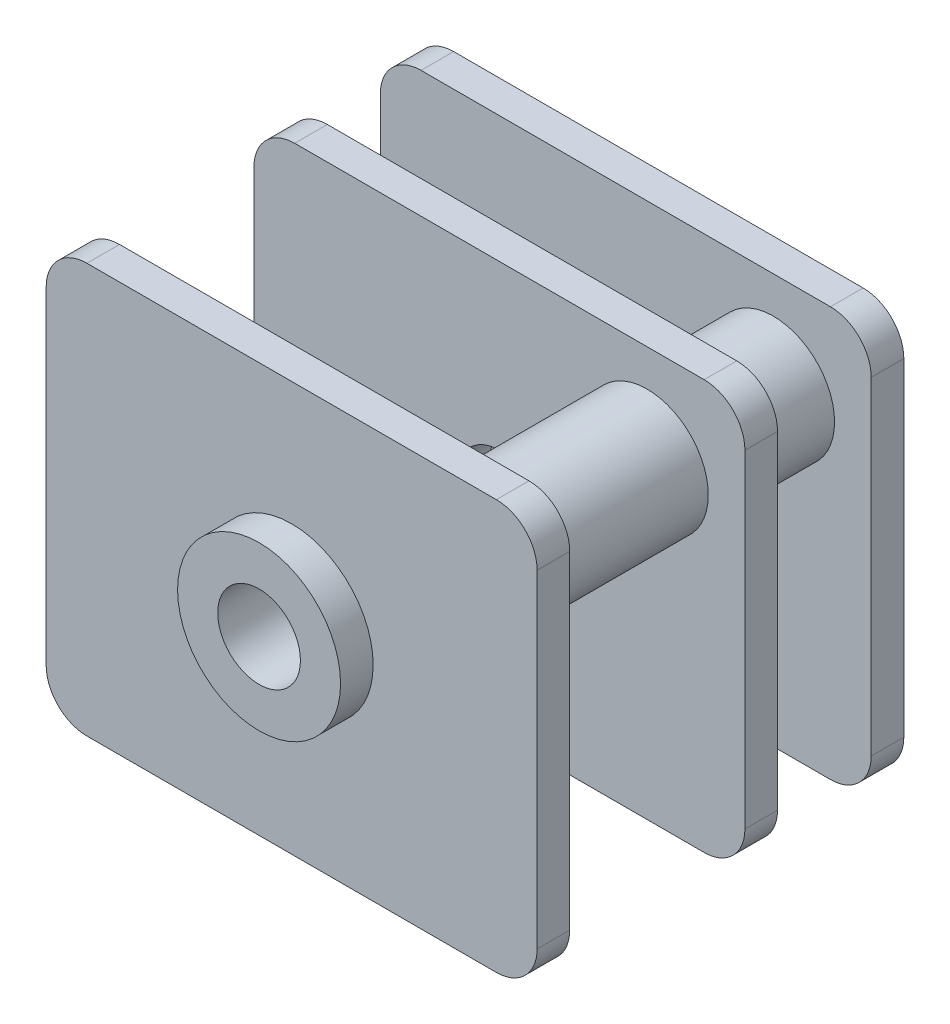
ISO-10303-21;
HEADER;
FILE_DESCRIPTION(('STEP AP214'),'2;1');
FILE_NAME('part.step','',(''),(''),'','','');
FILE_SCHEMA(('AUTOMOTIVE_DESIGN { 1 0 10303 214 1 1 1 1 }'));
ENDSEC;
DATA;
#1=APPLICATION_CONTEXT('core data for automotive mechanical design processes');
#2=APPLICATION_PROTOCOL_DEFINITION('international standard','automotive_design',2000,#1);
#3=PRODUCT_CONTEXT('',#1,'mechanical');
#4=PRODUCT('Part','Part','',(#3));
#5=PRODUCT_RELATED_PRODUCT_CATEGORY('part','',(#4));
#6=PRODUCT_DEFINITION_FORMATION('','',#4);
#7=PRODUCT_DEFINITION_CONTEXT('part definition',#1,'design');
#8=PRODUCT_DEFINITION('design','',#6,#7);
#9=PRODUCT_DEFINITION_SHAPE('','',#8);
#10=(LENGTH_UNIT() NAMED_UNIT(*) SI_UNIT(.MILLI.,.METRE.));
#11=(NAMED_UNIT(*) PLANE_ANGLE_UNIT() SI_UNIT($,.RADIAN.));
#12=(NAMED_UNIT(*) SI_UNIT($,.STERADIAN.) SOLID_ANGLE_UNIT());
#13=UNCERTAINTY_MEASURE_WITH_UNIT(LENGTH_MEASURE(1.E-05),#10,'distance_accuracy_value','');
#14=(GEOMETRIC_REPRESENTATION_CONTEXT(3) GLOBAL_UNCERTAINTY_ASSIGNED_CONTEXT((#13)) GLOBAL_UNIT_ASSIGNED_CONTEXT((#10,
#11,#12)) REPRESENTATION_CONTEXT('',''));
#15=CARTESIAN_POINT('',(0.,0.,0.));
#16=DIRECTION('',(0.,0.,1.));
#17=DIRECTION('',(1.,0.,0.));
#18=AXIS2_PLACEMENT_3D('',#15,#16,#17);
#19=CARTESIAN_POINT('',(3.625,2.625,8.2));
#20=DIRECTION('',(0.,0.,-1.));
#21=DIRECTION('',(-1.,0.,0.));
#22=AXIS2_PLACEMENT_3D('',#19,#20,#21);
#23=CYLINDRICAL_SURFACE('',#22,1.5);
#24=CARTESIAN_POINT('',(3.625,2.625,0.8));
#25=DIRECTION('',(0.,0.,1.));
#26=DIRECTION('',(1.,0.,0.));
#27=AXIS2_PLACEMENT_3D('',#24,#25,#26);
#28=CIRCLE('',#27,1.5);
#29=CARTESIAN_POINT('',(5.125,2.625,0.8));
#30=VERTEX_POINT('',#29);
#31=EDGE_CURVE('E400',#30,#30,#28,.T.);
#32=ORIENTED_EDGE('',*,*,#31,.T.);
#33=EDGE_LOOP('',(#32));
#34=FACE_BOUND('',#33,.T.);
#35=CARTESIAN_POINT('',(3.625,2.625,3.1));
#36=DIRECTION('',(0.,0.,1.));
#37=DIRECTION('',(1.,0.,0.));
#38=AXIS2_PLACEMENT_3D('',#35,#36,#37);
#39=CIRCLE('',#38,1.5);
#40=CARTESIAN_POINT('',(5.125,2.625,3.1));
#41=VERTEX_POINT('',#40);
#42=EDGE_CURVE('E265',#41,#41,#39,.T.);
#43=ORIENTED_EDGE('',*,*,#42,.F.);
#44=EDGE_LOOP('',(#43));
#45=FACE_BOUND('',#44,.T.);
#46=ADVANCED_FACE('F36',(#34,#45),#23,.T.);
#47=CARTESIAN_POINT('',(-3.625,-2.625,8.2));
#48=DIRECTION('',(0.,0.,-1.));
#49=DIRECTION('',(-1.,0.,0.));
#50=AXIS2_PLACEMENT_3D('',#47,#48,#49);
#51=CYLINDRICAL_SURFACE('',#50,1.5);
#52=CARTESIAN_POINT('',(-3.625,-2.625,0.8));
#53=DIRECTION('',(0.,0.,1.));
#54=DIRECTION('',(1.,0.,0.));
#55=AXIS2_PLACEMENT_3D('',#52,#53,#54);
#56=CIRCLE('',#55,1.5);
#57=CARTESIAN_POINT('',(-2.125,-2.625,0.8));
#58=VERTEX_POINT('',#57);
#59=EDGE_CURVE('E396',#58,#58,#56,.T.);
#60=ORIENTED_EDGE('',*,*,#59,.T.);
#61=EDGE_LOOP('',(#60));
#62=FACE_BOUND('',#61,.T.);
#63=CARTESIAN_POINT('',(-3.625,-2.625,3.1));
#64=DIRECTION('',(0.,0.,1.));
#65=DIRECTION('',(1.,0.,0.));
#66=AXIS2_PLACEMENT_3D('',#63,#64,#65);
#67=CIRCLE('',#66,1.5);
#68=CARTESIAN_POINT('',(-2.125,-2.625,3.1));
#69=VERTEX_POINT('',#68);
#70=EDGE_CURVE('E262',#69,#69,#67,.T.);
#71=ORIENTED_EDGE('',*,*,#70,.F.);
#72=EDGE_LOOP('',(#71));
#73=FACE_BOUND('',#72,.T.);
#74=ADVANCED_FACE('F442',(#62,#73),#51,.T.);
#75=CARTESIAN_POINT('',(6.025,5.025,0.8));
#76=DIRECTION('',(-1.,0.,0.));
#77=DIRECTION('',(0.,-1.,0.));
#78=AXIS2_PLACEMENT_3D('',#75,#76,#77);
#79=PLANE('',#78);
#80=DIRECTION('',(0.,1.,0.));
#81=VECTOR('',#80,1.);
#82=CARTESIAN_POINT('',(6.025,5.025,0.8));
#83=LINE('',#82,#81);
#84=CARTESIAN_POINT('',(6.025,-4.025,0.8));
#85=VERTEX_POINT('',#84);
#86=CARTESIAN_POINT('',(6.025,4.025,0.8));
#87=VERTEX_POINT('',#86);
#88=EDGE_CURVE('E227',#85,#87,#83,.T.);
#89=ORIENTED_EDGE('',*,*,#88,.F.);
#90=DIRECTION('',(0.,0.,-1.));
#91=VECTOR('',#90,1.);
#92=CARTESIAN_POINT('',(6.025,-4.025,0.8));
#93=LINE('',#92,#91);
#94=CARTESIAN_POINT('',(6.025,-4.025,0.));
#95=VERTEX_POINT('',#94);
#96=EDGE_CURVE('E259',#85,#95,#93,.T.);
#97=ORIENTED_EDGE('',*,*,#96,.T.);
#98=DIRECTION('',(0.,1.,0.));
#99=VECTOR('',#98,1.);
#100=CARTESIAN_POINT('',(6.025,5.025,0.));
#101=LINE('',#100,#99);
#102=CARTESIAN_POINT('',(6.025,4.025,0.));
#103=VERTEX_POINT('',#102);
#104=EDGE_CURVE('E406',#95,#103,#101,.T.);
#105=ORIENTED_EDGE('',*,*,#104,.T.);
#106=DIRECTION('',(0.,0.,-1.));
#107=VECTOR('',#106,1.);
#108=CARTESIAN_POINT('',(6.025,4.025,0.8));
#109=LINE('',#108,#107);
#110=EDGE_CURVE('E257',#103,#87,#109,.F.);
#111=ORIENTED_EDGE('',*,*,#110,.T.);
#112=EDGE_LOOP('',(#89,#97,#105,#111));
#113=FACE_BOUND('',#112,.T.);
#114=ADVANCED_FACE('F439',(#113),#79,.F.);
#115=CARTESIAN_POINT('',(-6.025,5.025,0.8));
#116=DIRECTION('',(0.,-1.,0.));
#117=DIRECTION('',(0.,0.,-1.));
#118=AXIS2_PLACEMENT_3D('',#115,#116,#117);
#119=PLANE('',#118);
#120=DIRECTION('',(-1.,0.,0.));
#121=VECTOR('',#120,1.);
#122=CARTESIAN_POINT('',(-6.025,5.025,0.));
#123=LINE('',#122,#121);
#124=CARTESIAN_POINT('',(5.025,5.025,0.));
#125=VERTEX_POINT('',#124);
#126=CARTESIAN_POINT('',(-5.025,5.025,0.));
#127=VERTEX_POINT('',#126);
#128=EDGE_CURVE('E233',#125,#127,#123,.T.);
#129=ORIENTED_EDGE('',*,*,#128,.T.);
#130=DIRECTION('',(0.,0.,-1.));
#131=VECTOR('',#130,1.);
#132=CARTESIAN_POINT('',(-5.025,5.025,0.8));
#133=LINE('',#132,#131);
#134=CARTESIAN_POINT('',(-5.025,5.025,0.8));
#135=VERTEX_POINT('',#134);
#136=EDGE_CURVE('E255',#127,#135,#133,.F.);
#137=ORIENTED_EDGE('',*,*,#136,.T.);
#138=DIRECTION('',(-1.,0.,0.));
#139=VECTOR('',#138,1.);
#140=CARTESIAN_POINT('',(-6.025,5.025,0.8));
#141=LINE('',#140,#139);
#142=CARTESIAN_POINT('',(5.025,5.025,0.8));
#143=VERTEX_POINT('',#142);
#144=EDGE_CURVE('E231',#143,#135,#141,.T.);
#145=ORIENTED_EDGE('',*,*,#144,.F.);
#146=DIRECTION('',(0.,0.,-1.));
#147=VECTOR('',#146,1.);
#148=CARTESIAN_POINT('',(5.025,5.025,0.8));
#149=LINE('',#148,#147);
#150=EDGE_CURVE('E252',#143,#125,#149,.T.);
#151=ORIENTED_EDGE('',*,*,#150,.T.);
#152=EDGE_LOOP('',(#129,#137,#145,#151));
#153=FACE_BOUND('',#152,.T.);
#154=ADVANCED_FACE('F420',(#153),#119,.F.);
#155=CARTESIAN_POINT('',(-6.025,5.025,0.8));
#156=DIRECTION('',(1.,0.,0.));
#157=DIRECTION('',(0.,1.,0.));
#158=AXIS2_PLACEMENT_3D('',#155,#156,#157);
#159=PLANE('',#158);
#160=DIRECTION('',(0.,-1.,0.));
#161=VECTOR('',#160,1.);
#162=CARTESIAN_POINT('',(-6.025,5.025,0.));
#163=LINE('',#162,#161);
#164=CARTESIAN_POINT('',(-6.025,4.025,0.));
#165=VERTEX_POINT('',#164);
#166=CARTESIAN_POINT('',(-6.025,-4.025,0.));
#167=VERTEX_POINT('',#166);
#168=EDGE_CURVE('E228',#165,#167,#163,.T.);
#169=ORIENTED_EDGE('',*,*,#168,.T.);
#170=DIRECTION('',(0.,0.,-1.));
#171=VECTOR('',#170,1.);
#172=CARTESIAN_POINT('',(-6.025,-4.025,0.8));
#173=LINE('',#172,#171);
#174=CARTESIAN_POINT('',(-6.025,-4.025,0.8));
#175=VERTEX_POINT('',#174);
#176=EDGE_CURVE('E205',#167,#175,#173,.F.);
#177=ORIENTED_EDGE('',*,*,#176,.T.);
#178=DIRECTION('',(0.,-1.,0.));
#179=VECTOR('',#178,1.);
#180=CARTESIAN_POINT('',(-6.025,5.025,0.8));
#181=LINE('',#180,#179);
#182=CARTESIAN_POINT('',(-6.025,4.025,0.8));
#183=VERTEX_POINT('',#182);
#184=EDGE_CURVE('E411',#183,#175,#181,.T.);
#185=ORIENTED_EDGE('',*,*,#184,.F.);
#186=DIRECTION('',(0.,0.,-1.));
#187=VECTOR('',#186,1.);
#188=CARTESIAN_POINT('',(-6.025,4.025,0.8));
#189=LINE('',#188,#187);
#190=EDGE_CURVE('E210',#183,#165,#189,.T.);
#191=ORIENTED_EDGE('',*,*,#190,.T.);
#192=EDGE_LOOP('',(#169,#177,#185,#191));
#193=FACE_BOUND('',#192,.T.);
#194=ADVANCED_FACE('F431',(#193),#159,.F.);
#195=CARTESIAN_POINT('',(-6.025,-5.025,0.8));
#196=DIRECTION('',(0.,1.,0.));
#197=DIRECTION('',(-1.,0.,0.));
#198=AXIS2_PLACEMENT_3D('',#195,#196,#197);
#199=PLANE('',#198);
#200=DIRECTION('',(1.,0.,0.));
#201=VECTOR('',#200,1.);
#202=CARTESIAN_POINT('',(-6.025,-5.025,0.8));
#203=LINE('',#202,#201);
#204=CARTESIAN_POINT('',(-5.025,-5.025,0.8));
#205=VERTEX_POINT('',#204);
#206=CARTESIAN_POINT('',(5.025,-5.025,0.8));
#207=VERTEX_POINT('',#206);
#208=EDGE_CURVE('E220',#205,#207,#203,.T.);
#209=ORIENTED_EDGE('',*,*,#208,.F.);
#210=DIRECTION('',(0.,0.,-1.));
#211=VECTOR('',#210,1.);
#212=CARTESIAN_POINT('',(-5.025,-5.025,0.8));
#213=LINE('',#212,#211);
#214=CARTESIAN_POINT('',(-5.025,-5.025,0.));
#215=VERTEX_POINT('',#214);
#216=EDGE_CURVE('E204',#205,#215,#213,.T.);
#217=ORIENTED_EDGE('',*,*,#216,.T.);
#218=DIRECTION('',(1.,0.,0.));
#219=VECTOR('',#218,1.);
#220=CARTESIAN_POINT('',(-6.025,-5.025,0.));
#221=LINE('',#220,#219);
#222=CARTESIAN_POINT('',(5.025,-5.025,0.));
#223=VERTEX_POINT('',#222);
#224=EDGE_CURVE('E217',#215,#223,#221,.T.);
#225=ORIENTED_EDGE('',*,*,#224,.T.);
#226=DIRECTION('',(0.,0.,-1.));
#227=VECTOR('',#226,1.);
#228=CARTESIAN_POINT('',(5.025,-5.025,0.8));
#229=LINE('',#228,#227);
#230=EDGE_CURVE('E222',#223,#207,#229,.F.);
#231=ORIENTED_EDGE('',*,*,#230,.T.);
#232=EDGE_LOOP('',(#209,#217,#225,#231));
#233=FACE_BOUND('',#232,.T.);
#234=ADVANCED_FACE('F216',(#233),#199,.F.);
#235=CARTESIAN_POINT('',(0.,0.,0.8));
#236=DIRECTION('',(0.,0.,1.));
#237=DIRECTION('',(1.,0.,0.));
#238=AXIS2_PLACEMENT_3D('',#235,#236,#237);
#239=PLANE('',#238);
#240=CARTESIAN_POINT('',(0.,0.,0.8));
#241=DIRECTION('',(0.,0.,1.));
#242=DIRECTION('',(1.,0.,0.));
#243=AXIS2_PLACEMENT_3D('',#240,#241,#242);
#244=CIRCLE('',#243,1.015);
#245=CARTESIAN_POINT('',(1.015,0.,0.8));
#246=VERTEX_POINT('',#245);
#247=EDGE_CURVE('E588',#246,#246,#244,.F.);
#248=ORIENTED_EDGE('',*,*,#247,.T.);
#249=EDGE_LOOP('',(#248));
#250=FACE_BOUND('',#249,.T.);
#251=ORIENTED_EDGE('',*,*,#59,.F.);
#252=EDGE_LOOP('',(#251));
#253=FACE_BOUND('',#252,.T.);
#254=ORIENTED_EDGE('',*,*,#31,.F.);
#255=EDGE_LOOP('',(#254));
#256=FACE_BOUND('',#255,.T.);
#257=ORIENTED_EDGE('',*,*,#184,.T.);
#258=CARTESIAN_POINT('',(-5.025,-4.025,0.8));
#259=DIRECTION('',(0.,0.,1.));
#260=DIRECTION('',(1.,0.,0.));
#261=AXIS2_PLACEMENT_3D('',#258,#259,#260);
#262=CIRCLE('',#261,1.);
#263=EDGE_CURVE('E250',#175,#205,#262,.T.);
#264=ORIENTED_EDGE('',*,*,#263,.T.);
#265=ORIENTED_EDGE('',*,*,#208,.T.);
#266=CARTESIAN_POINT('',(5.025,-4.025,0.8));
#267=DIRECTION('',(0.,0.,1.));
#268=DIRECTION('',(1.,0.,0.));
#269=AXIS2_PLACEMENT_3D('',#266,#267,#268);
#270=CIRCLE('',#269,1.);
#271=EDGE_CURVE('E246',#207,#85,#270,.T.);
#272=ORIENTED_EDGE('',*,*,#271,.T.);
#273=ORIENTED_EDGE('',*,*,#88,.T.);
#274=CARTESIAN_POINT('',(5.025,4.025,0.8));
#275=DIRECTION('',(0.,0.,1.));
#276=DIRECTION('',(1.,0.,0.));
#277=AXIS2_PLACEMENT_3D('',#274,#275,#276);
#278=CIRCLE('',#277,1.);
#279=EDGE_CURVE('E244',#87,#143,#278,.T.);
#280=ORIENTED_EDGE('',*,*,#279,.T.);
#281=ORIENTED_EDGE('',*,*,#144,.T.);
#282=CARTESIAN_POINT('',(-5.025,4.025,0.8));
#283=DIRECTION('',(0.,0.,1.));
#284=DIRECTION('',(1.,0.,0.));
#285=AXIS2_PLACEMENT_3D('',#282,#283,#284);
#286=CIRCLE('',#285,1.);
#287=EDGE_CURVE('E248',#135,#183,#286,.T.);
#288=ORIENTED_EDGE('',*,*,#287,.T.);
#289=EDGE_LOOP('',(#257,#264,#265,#272,#273,#280,#281,#288));
#290=FACE_BOUND('',#289,.T.);
#291=ADVANCED_FACE('F429',(#250,#253,#256,#290),#239,.T.);
#292=CARTESIAN_POINT('',(0.,0.,0.));
#293=DIRECTION('',(0.,0.,1.));
#294=DIRECTION('',(1.,0.,0.));
#295=AXIS2_PLACEMENT_3D('',#292,#293,#294);
#296=PLANE('',#295);
#297=CARTESIAN_POINT('',(0.,0.,0.));
#298=DIRECTION('',(0.,0.,1.));
#299=DIRECTION('',(1.,0.,0.));
#300=AXIS2_PLACEMENT_3D('',#297,#298,#299);
#301=CIRCLE('',#300,1.015);
#302=CARTESIAN_POINT('',(1.015,0.,0.));
#303=VERTEX_POINT('',#302);
#304=EDGE_CURVE('E600',#303,#303,#301,.T.);
#305=ORIENTED_EDGE('',*,*,#304,.T.);
#306=EDGE_LOOP('',(#305));
#307=FACE_BOUND('',#306,.T.);
#308=ORIENTED_EDGE('',*,*,#224,.F.);
#309=CARTESIAN_POINT('',(-5.025,-4.025,0.));
#310=DIRECTION('',(0.,0.,1.));
#311=DIRECTION('',(1.,0.,0.));
#312=AXIS2_PLACEMENT_3D('',#309,#310,#311);
#313=CIRCLE('',#312,1.);
#314=EDGE_CURVE('E200',#215,#167,#313,.F.);
#315=ORIENTED_EDGE('',*,*,#314,.T.);
#316=ORIENTED_EDGE('',*,*,#168,.F.);
#317=CARTESIAN_POINT('',(-5.025,4.025,0.));
#318=DIRECTION('',(0.,0.,1.));
#319=DIRECTION('',(1.,0.,0.));
#320=AXIS2_PLACEMENT_3D('',#317,#318,#319);
#321=CIRCLE('',#320,1.);
#322=EDGE_CURVE('E211',#165,#127,#321,.F.);
#323=ORIENTED_EDGE('',*,*,#322,.T.);
#324=ORIENTED_EDGE('',*,*,#128,.F.);
#325=CARTESIAN_POINT('',(5.025,4.025,0.));
#326=DIRECTION('',(0.,0.,1.));
#327=DIRECTION('',(1.,0.,0.));
#328=AXIS2_PLACEMENT_3D('',#325,#326,#327);
#329=CIRCLE('',#328,1.);
#330=EDGE_CURVE('E221',#125,#103,#329,.F.);
#331=ORIENTED_EDGE('',*,*,#330,.T.);
#332=ORIENTED_EDGE('',*,*,#104,.F.);
#333=CARTESIAN_POINT('',(5.025,-4.025,0.));
#334=DIRECTION('',(0.,0.,1.));
#335=DIRECTION('',(1.,0.,0.));
#336=AXIS2_PLACEMENT_3D('',#333,#334,#335);
#337=CIRCLE('',#336,1.);
#338=EDGE_CURVE('E226',#95,#223,#337,.F.);
#339=ORIENTED_EDGE('',*,*,#338,.T.);
#340=EDGE_LOOP('',(#308,#315,#316,#323,#324,#331,#332,#339));
#341=FACE_BOUND('',#340,.T.);
#342=ADVANCED_FACE('F224',(#307,#341),#296,.F.);
#343=CARTESIAN_POINT('',(-5.025,-4.025,0.8));
#344=DIRECTION('',(0.,0.,-1.));
#345=DIRECTION('',(-1.,0.,0.));
#346=AXIS2_PLACEMENT_3D('',#343,#344,#345);
#347=CYLINDRICAL_SURFACE('',#346,1.);
#348=ORIENTED_EDGE('',*,*,#263,.F.);
#349=ORIENTED_EDGE('',*,*,#176,.F.);
#350=ORIENTED_EDGE('',*,*,#314,.F.);
#351=ORIENTED_EDGE('',*,*,#216,.F.);
#352=EDGE_LOOP('',(#348,#349,#350,#351));
#353=FACE_BOUND('',#352,.T.);
#354=ADVANCED_FACE('F203',(#353),#347,.T.);
#355=CARTESIAN_POINT('',(-5.025,4.025,0.8));
#356=DIRECTION('',(0.,0.,-1.));
#357=DIRECTION('',(-1.,0.,0.));
#358=AXIS2_PLACEMENT_3D('',#355,#356,#357);
#359=CYLINDRICAL_SURFACE('',#358,1.);
#360=ORIENTED_EDGE('',*,*,#287,.F.);
#361=ORIENTED_EDGE('',*,*,#136,.F.);
#362=ORIENTED_EDGE('',*,*,#322,.F.);
#363=ORIENTED_EDGE('',*,*,#190,.F.);
#364=EDGE_LOOP('',(#360,#361,#362,#363));
#365=FACE_BOUND('',#364,.T.);
#366=ADVANCED_FACE('F425',(#365),#359,.T.);
#367=CARTESIAN_POINT('',(5.025,-4.025,0.8));
#368=DIRECTION('',(0.,0.,-1.));
#369=DIRECTION('',(-1.,0.,0.));
#370=AXIS2_PLACEMENT_3D('',#367,#368,#369);
#371=CYLINDRICAL_SURFACE('',#370,1.);
#372=ORIENTED_EDGE('',*,*,#271,.F.);
#373=ORIENTED_EDGE('',*,*,#230,.F.);
#374=ORIENTED_EDGE('',*,*,#338,.F.);
#375=ORIENTED_EDGE('',*,*,#96,.F.);
#376=EDGE_LOOP('',(#372,#373,#374,#375));
#377=FACE_BOUND('',#376,.T.);
#378=ADVANCED_FACE('F528',(#377),#371,.T.);
#379=CARTESIAN_POINT('',(5.025,4.025,0.8));
#380=DIRECTION('',(0.,0.,-1.));
#381=DIRECTION('',(-1.,0.,0.));
#382=AXIS2_PLACEMENT_3D('',#379,#380,#381);
#383=CYLINDRICAL_SURFACE('',#382,1.);
#384=ORIENTED_EDGE('',*,*,#279,.F.);
#385=ORIENTED_EDGE('',*,*,#110,.F.);
#386=ORIENTED_EDGE('',*,*,#330,.F.);
#387=ORIENTED_EDGE('',*,*,#150,.F.);
#388=EDGE_LOOP('',(#384,#385,#386,#387));
#389=FACE_BOUND('',#388,.T.);
#390=ADVANCED_FACE('F523',(#389),#383,.T.);
#391=CARTESIAN_POINT('',(6.025,5.025,3.9));
#392=DIRECTION('',(-1.,0.,0.));
#393=DIRECTION('',(0.,-1.,0.));
#394=AXIS2_PLACEMENT_3D('',#391,#392,#393);
#395=PLANE('',#394);
#396=DIRECTION('',(0.,1.,0.));
#397=VECTOR('',#396,1.);
#398=CARTESIAN_POINT('',(6.025,5.025,3.9));
#399=LINE('',#398,#397);
#400=CARTESIAN_POINT('',(6.025,-4.025,3.9));
#401=VERTEX_POINT('',#400);
#402=CARTESIAN_POINT('',(6.025,4.025,3.9));
#403=VERTEX_POINT('',#402);
#404=EDGE_CURVE('E369',#401,#403,#399,.T.);
#405=ORIENTED_EDGE('',*,*,#404,.F.);
#406=DIRECTION('',(0.,0.,-1.));
#407=VECTOR('',#406,1.);
#408=CARTESIAN_POINT('',(6.025,-4.025,3.9));
#409=LINE('',#408,#407);
#410=CARTESIAN_POINT('',(6.025,-4.025,3.1));
#411=VERTEX_POINT('',#410);
#412=EDGE_CURVE('E304',#401,#411,#409,.T.);
#413=ORIENTED_EDGE('',*,*,#412,.T.);
#414=DIRECTION('',(0.,1.,0.));
#415=VECTOR('',#414,1.);
#416=CARTESIAN_POINT('',(6.025,5.025,3.1));
#417=LINE('',#416,#415);
#418=CARTESIAN_POINT('',(6.025,4.025,3.1));
#419=VERTEX_POINT('',#418);
#420=EDGE_CURVE('E381',#411,#419,#417,.T.);
#421=ORIENTED_EDGE('',*,*,#420,.T.);
#422=DIRECTION('',(0.,0.,-1.));
#423=VECTOR('',#422,1.);
#424=CARTESIAN_POINT('',(6.025,4.025,3.9));
#425=LINE('',#424,#423);
#426=EDGE_CURVE('E302',#419,#403,#425,.F.);
#427=ORIENTED_EDGE('',*,*,#426,.T.);
#428=EDGE_LOOP('',(#405,#413,#421,#427));
#429=FACE_BOUND('',#428,.T.);
#430=ADVANCED_FACE('F520',(#429),#395,.F.);
#431=CARTESIAN_POINT('',(-6.025,5.025,3.9));
#432=DIRECTION('',(0.,-1.,0.));
#433=DIRECTION('',(0.,0.,-1.));
#434=AXIS2_PLACEMENT_3D('',#431,#432,#433);
#435=PLANE('',#434);
#436=DIRECTION('',(-1.,0.,0.));
#437=VECTOR('',#436,1.);
#438=CARTESIAN_POINT('',(-6.025,5.025,3.1));
#439=LINE('',#438,#437);
#440=CARTESIAN_POINT('',(5.025,5.025,3.1));
#441=VERTEX_POINT('',#440);
#442=CARTESIAN_POINT('',(-5.025,5.025,3.1));
#443=VERTEX_POINT('',#442);
#444=EDGE_CURVE('E384',#441,#443,#439,.T.);
#445=ORIENTED_EDGE('',*,*,#444,.T.);
#446=DIRECTION('',(0.,0.,-1.));
#447=VECTOR('',#446,1.);
#448=CARTESIAN_POINT('',(-5.025,5.025,3.9));
#449=LINE('',#448,#447);
#450=CARTESIAN_POINT('',(-5.025,5.025,3.9));
#451=VERTEX_POINT('',#450);
#452=EDGE_CURVE('E300',#443,#451,#449,.F.);
#453=ORIENTED_EDGE('',*,*,#452,.T.);
#454=DIRECTION('',(-1.,0.,0.));
#455=VECTOR('',#454,1.);
#456=CARTESIAN_POINT('',(-6.025,5.025,3.9));
#457=LINE('',#456,#455);
#458=CARTESIAN_POINT('',(5.025,5.025,3.9));
#459=VERTEX_POINT('',#458);
#460=EDGE_CURVE('E372',#459,#451,#457,.T.);
#461=ORIENTED_EDGE('',*,*,#460,.F.);
#462=DIRECTION('',(0.,0.,-1.));
#463=VECTOR('',#462,1.);
#464=CARTESIAN_POINT('',(5.025,5.025,3.9));
#465=LINE('',#464,#463);
#466=EDGE_CURVE('E297',#459,#441,#465,.T.);
#467=ORIENTED_EDGE('',*,*,#466,.T.);
#468=EDGE_LOOP('',(#445,#453,#461,#467));
#469=FACE_BOUND('',#468,.T.);
#470=ADVANCED_FACE('F516',(#469),#435,.F.);
#471=CARTESIAN_POINT('',(-6.025,5.025,3.9));
#472=DIRECTION('',(1.,0.,0.));
#473=DIRECTION('',(0.,1.,0.));
#474=AXIS2_PLACEMENT_3D('',#471,#472,#473);
#475=PLANE('',#474);
#476=DIRECTION('',(0.,-1.,0.));
#477=VECTOR('',#476,1.);
#478=CARTESIAN_POINT('',(-6.025,5.025,3.1));
#479=LINE('',#478,#477);
#480=CARTESIAN_POINT('',(-6.025,4.025,3.1));
#481=VERTEX_POINT('',#480);
#482=CARTESIAN_POINT('',(-6.025,-4.025,3.1));
#483=VERTEX_POINT('',#482);
#484=EDGE_CURVE('E387',#481,#483,#479,.T.);
#485=ORIENTED_EDGE('',*,*,#484,.T.);
#486=DIRECTION('',(0.,0.,-1.));
#487=VECTOR('',#486,1.);
#488=CARTESIAN_POINT('',(-6.025,-4.025,3.9));
#489=LINE('',#488,#487);
#490=CARTESIAN_POINT('',(-6.025,-4.025,3.9));
#491=VERTEX_POINT('',#490);
#492=EDGE_CURVE('E287',#483,#491,#489,.F.);
#493=ORIENTED_EDGE('',*,*,#492,.T.);
#494=DIRECTION('',(0.,-1.,0.));
#495=VECTOR('',#494,1.);
#496=CARTESIAN_POINT('',(-6.025,5.025,3.9));
#497=LINE('',#496,#495);
#498=CARTESIAN_POINT('',(-6.025,4.025,3.9));
#499=VERTEX_POINT('',#498);
#500=EDGE_CURVE('E376',#499,#491,#497,.T.);
#501=ORIENTED_EDGE('',*,*,#500,.F.);
#502=DIRECTION('',(0.,0.,-1.));
#503=VECTOR('',#502,1.);
#504=CARTESIAN_POINT('',(-6.025,4.025,3.9));
#505=LINE('',#504,#503);
#506=EDGE_CURVE('E284',#499,#481,#505,.T.);
#507=ORIENTED_EDGE('',*,*,#506,.T.);
#508=EDGE_LOOP('',(#485,#493,#501,#507));
#509=FACE_BOUND('',#508,.T.);
#510=ADVANCED_FACE('F512',(#509),#475,.F.);
#511=CARTESIAN_POINT('',(-6.025,-5.025,3.9));
#512=DIRECTION('',(0.,1.,0.));
#513=DIRECTION('',(-1.,0.,0.));
#514=AXIS2_PLACEMENT_3D('',#511,#512,#513);
#515=PLANE('',#514);
#516=DIRECTION('',(1.,0.,0.));
#517=VECTOR('',#516,1.);
#518=CARTESIAN_POINT('',(-6.025,-5.025,3.9));
#519=LINE('',#518,#517);
#520=CARTESIAN_POINT('',(-5.025,-5.025,3.9));
#521=VERTEX_POINT('',#520);
#522=CARTESIAN_POINT('',(5.025,-5.025,3.9));
#523=VERTEX_POINT('',#522);
#524=EDGE_CURVE('E270',#521,#523,#519,.T.);
#525=ORIENTED_EDGE('',*,*,#524,.F.);
#526=DIRECTION('',(0.,0.,-1.));
#527=VECTOR('',#526,1.);
#528=CARTESIAN_POINT('',(-5.025,-5.025,3.9));
#529=LINE('',#528,#527);
#530=CARTESIAN_POINT('',(-5.025,-5.025,3.1));
#531=VERTEX_POINT('',#530);
#532=EDGE_CURVE('E273',#521,#531,#529,.T.);
#533=ORIENTED_EDGE('',*,*,#532,.T.);
#534=DIRECTION('',(1.,0.,0.));
#535=VECTOR('',#534,1.);
#536=CARTESIAN_POINT('',(-6.025,-5.025,3.1));
#537=LINE('',#536,#535);
#538=CARTESIAN_POINT('',(5.025,-5.025,3.1));
#539=VERTEX_POINT('',#538);
#540=EDGE_CURVE('E373',#531,#539,#537,.T.);
#541=ORIENTED_EDGE('',*,*,#540,.T.);
#542=DIRECTION('',(0.,0.,-1.));
#543=VECTOR('',#542,1.);
#544=CARTESIAN_POINT('',(5.025,-5.025,3.9));
#545=LINE('',#544,#543);
#546=EDGE_CURVE('E271',#539,#523,#545,.F.);
#547=ORIENTED_EDGE('',*,*,#546,.T.);
#548=EDGE_LOOP('',(#525,#533,#541,#547));
#549=FACE_BOUND('',#548,.T.);
#550=ADVANCED_FACE('F505',(#549),#515,.F.);
#551=CARTESIAN_POINT('',(0.,0.,3.9));
#552=DIRECTION('',(0.,0.,1.));
#553=DIRECTION('',(1.,0.,0.));
#554=AXIS2_PLACEMENT_3D('',#551,#552,#553);
#555=PLANE('',#554);
#556=CARTESIAN_POINT('',(0.,0.,3.9));
#557=DIRECTION('',(0.,0.,1.));
#558=DIRECTION('',(1.,0.,0.));
#559=AXIS2_PLACEMENT_3D('',#556,#557,#558);
#560=CIRCLE('',#559,1.015);
#561=CARTESIAN_POINT('',(1.015,0.,3.9));
#562=VERTEX_POINT('',#561);
#563=EDGE_CURVE('E591',#562,#562,#560,.F.);
#564=ORIENTED_EDGE('',*,*,#563,.T.);
#565=EDGE_LOOP('',(#564));
#566=FACE_BOUND('',#565,.T.);
#567=CARTESIAN_POINT('',(3.625,2.625,3.9));
#568=DIRECTION('',(0.,0.,1.));
#569=DIRECTION('',(1.,0.,0.));
#570=AXIS2_PLACEMENT_3D('',#567,#568,#569);
#571=CIRCLE('',#570,1.5);
#572=CARTESIAN_POINT('',(5.125,2.625,3.9));
#573=VERTEX_POINT('',#572);
#574=EDGE_CURVE('E269',#573,#573,#571,.T.);
#575=ORIENTED_EDGE('',*,*,#574,.F.);
#576=EDGE_LOOP('',(#575));
#577=FACE_BOUND('',#576,.T.);
#578=CARTESIAN_POINT('',(-3.625,-2.625,3.9));
#579=DIRECTION('',(0.,0.,1.));
#580=DIRECTION('',(1.,0.,0.));
#581=AXIS2_PLACEMENT_3D('',#578,#579,#580);
#582=CIRCLE('',#581,1.5);
#583=CARTESIAN_POINT('',(-2.125,-2.625,3.9));
#584=VERTEX_POINT('',#583);
#585=EDGE_CURVE('E266',#584,#584,#582,.T.);
#586=ORIENTED_EDGE('',*,*,#585,.F.);
#587=EDGE_LOOP('',(#586));
#588=FACE_BOUND('',#587,.T.);
#589=ORIENTED_EDGE('',*,*,#500,.T.);
#590=CARTESIAN_POINT('',(-5.025,-4.025,3.9));
#591=DIRECTION('',(0.,0.,1.));
#592=DIRECTION('',(1.,0.,0.));
#593=AXIS2_PLACEMENT_3D('',#590,#591,#592);
#594=CIRCLE('',#593,1.);
#595=EDGE_CURVE('E295',#491,#521,#594,.T.);
#596=ORIENTED_EDGE('',*,*,#595,.T.);
#597=ORIENTED_EDGE('',*,*,#524,.T.);
#598=CARTESIAN_POINT('',(5.025,-4.025,3.9));
#599=DIRECTION('',(0.,0.,1.));
#600=DIRECTION('',(1.,0.,0.));
#601=AXIS2_PLACEMENT_3D('',#598,#599,#600);
#602=CIRCLE('',#601,1.);
#603=EDGE_CURVE('E291',#523,#401,#602,.T.);
#604=ORIENTED_EDGE('',*,*,#603,.T.);
#605=ORIENTED_EDGE('',*,*,#404,.T.);
#606=CARTESIAN_POINT('',(5.025,4.025,3.9));
#607=DIRECTION('',(0.,0.,1.));
#608=DIRECTION('',(1.,0.,0.));
#609=AXIS2_PLACEMENT_3D('',#606,#607,#608);
#610=CIRCLE('',#609,1.);
#611=EDGE_CURVE('E289',#403,#459,#610,.T.);
#612=ORIENTED_EDGE('',*,*,#611,.T.);
#613=ORIENTED_EDGE('',*,*,#460,.T.);
#614=CARTESIAN_POINT('',(-5.025,4.025,3.9));
#615=DIRECTION('',(0.,0.,1.));
#616=DIRECTION('',(1.,0.,0.));
#617=AXIS2_PLACEMENT_3D('',#614,#615,#616);
#618=CIRCLE('',#617,1.);
#619=EDGE_CURVE('E293',#451,#499,#618,.T.);
#620=ORIENTED_EDGE('',*,*,#619,.T.);
#621=EDGE_LOOP('',(#589,#596,#597,#604,#605,#612,#613,#620));
#622=FACE_BOUND('',#621,.T.);
#623=ADVANCED_FACE('F502',(#566,#577,#588,#622),#555,.T.);
#624=CARTESIAN_POINT('',(0.,0.,3.1));
#625=DIRECTION('',(0.,0.,1.));
#626=DIRECTION('',(1.,0.,0.));
#627=AXIS2_PLACEMENT_3D('',#624,#625,#626);
#628=PLANE('',#627);
#629=CARTESIAN_POINT('',(0.,0.,3.1));
#630=DIRECTION('',(0.,0.,1.));
#631=DIRECTION('',(1.,0.,0.));
#632=AXIS2_PLACEMENT_3D('',#629,#630,#631);
#633=CIRCLE('',#632,1.015);
#634=CARTESIAN_POINT('',(1.015,0.,3.1));
#635=VERTEX_POINT('',#634);
#636=EDGE_CURVE('E594',#635,#635,#633,.F.);
#637=ORIENTED_EDGE('',*,*,#636,.F.);
#638=EDGE_LOOP('',(#637));
#639=FACE_BOUND('',#638,.T.);
#640=ORIENTED_EDGE('',*,*,#42,.T.);
#641=EDGE_LOOP('',(#640));
#642=FACE_BOUND('',#641,.T.);
#643=ORIENTED_EDGE('',*,*,#70,.T.);
#644=EDGE_LOOP('',(#643));
#645=FACE_BOUND('',#644,.T.);
#646=ORIENTED_EDGE('',*,*,#540,.F.);
#647=CARTESIAN_POINT('',(-5.025,-4.025,3.1));
#648=DIRECTION('',(0.,0.,1.));
#649=DIRECTION('',(1.,0.,0.));
#650=AXIS2_PLACEMENT_3D('',#647,#648,#649);
#651=CIRCLE('',#650,1.);
#652=EDGE_CURVE('E282',#531,#483,#651,.F.);
#653=ORIENTED_EDGE('',*,*,#652,.T.);
#654=ORIENTED_EDGE('',*,*,#484,.F.);
#655=CARTESIAN_POINT('',(-5.025,4.025,3.1));
#656=DIRECTION('',(0.,0.,1.));
#657=DIRECTION('',(1.,0.,0.));
#658=AXIS2_PLACEMENT_3D('',#655,#656,#657);
#659=CIRCLE('',#658,1.);
#660=EDGE_CURVE('E280',#481,#443,#659,.F.);
#661=ORIENTED_EDGE('',*,*,#660,.T.);
#662=ORIENTED_EDGE('',*,*,#444,.F.);
#663=CARTESIAN_POINT('',(5.025,4.025,3.1));
#664=DIRECTION('',(0.,0.,1.));
#665=DIRECTION('',(1.,0.,0.));
#666=AXIS2_PLACEMENT_3D('',#663,#664,#665);
#667=CIRCLE('',#666,1.);
#668=EDGE_CURVE('E276',#441,#419,#667,.F.);
#669=ORIENTED_EDGE('',*,*,#668,.T.);
#670=ORIENTED_EDGE('',*,*,#420,.F.);
#671=CARTESIAN_POINT('',(5.025,-4.025,3.1));
#672=DIRECTION('',(0.,0.,1.));
#673=DIRECTION('',(1.,0.,0.));
#674=AXIS2_PLACEMENT_3D('',#671,#672,#673);
#675=CIRCLE('',#674,1.);
#676=EDGE_CURVE('E278',#411,#539,#675,.F.);
#677=ORIENTED_EDGE('',*,*,#676,.T.);
#678=EDGE_LOOP('',(#646,#653,#654,#661,#662,#669,#670,#677));
#679=FACE_BOUND('',#678,.T.);
#680=ADVANCED_FACE('F464',(#639,#642,#645,#679),#628,.F.);
#681=ORIENTED_EDGE('',*,*,#585,.T.);
#682=EDGE_LOOP('',(#681));
#683=FACE_BOUND('',#682,.T.);
#684=CARTESIAN_POINT('',(-3.625,-2.625,8.2));
#685=DIRECTION('',(0.,0.,1.));
#686=DIRECTION('',(1.,0.,0.));
#687=AXIS2_PLACEMENT_3D('',#684,#685,#686);
#688=CIRCLE('',#687,1.5);
#689=CARTESIAN_POINT('',(-2.125,-2.625,8.2));
#690=VERTEX_POINT('',#689);
#691=EDGE_CURVE('E397',#690,#690,#688,.T.);
#692=ORIENTED_EDGE('',*,*,#691,.F.);
#693=EDGE_LOOP('',(#692));
#694=FACE_BOUND('',#693,.T.);
#695=ADVANCED_FACE('F451',(#683,#694),#51,.T.);
#696=ORIENTED_EDGE('',*,*,#574,.T.);
#697=EDGE_LOOP('',(#696));
#698=FACE_BOUND('',#697,.T.);
#699=CARTESIAN_POINT('',(3.625,2.625,8.2));
#700=DIRECTION('',(0.,0.,1.));
#701=DIRECTION('',(1.,0.,0.));
#702=AXIS2_PLACEMENT_3D('',#699,#700,#701);
#703=CIRCLE('',#702,1.5);
#704=CARTESIAN_POINT('',(5.125,2.625,8.2));
#705=VERTEX_POINT('',#704);
#706=EDGE_CURVE('E403',#705,#705,#703,.T.);
#707=ORIENTED_EDGE('',*,*,#706,.F.);
#708=EDGE_LOOP('',(#707));
#709=FACE_BOUND('',#708,.T.);
#710=ADVANCED_FACE('F445',(#698,#709),#23,.T.);
#711=CARTESIAN_POINT('',(-5.025,-4.025,3.9));
#712=DIRECTION('',(0.,0.,-1.));
#713=DIRECTION('',(-1.,0.,0.));
#714=AXIS2_PLACEMENT_3D('',#711,#712,#713);
#715=CYLINDRICAL_SURFACE('',#714,1.);
#716=ORIENTED_EDGE('',*,*,#595,.F.);
#717=ORIENTED_EDGE('',*,*,#492,.F.);
#718=ORIENTED_EDGE('',*,*,#652,.F.);
#719=ORIENTED_EDGE('',*,*,#532,.F.);
#720=EDGE_LOOP('',(#716,#717,#718,#719));
#721=FACE_BOUND('',#720,.T.);
#722=ADVANCED_FACE('F455',(#721),#715,.T.);
#723=CARTESIAN_POINT('',(-5.025,4.025,3.9));
#724=DIRECTION('',(0.,0.,-1.));
#725=DIRECTION('',(-1.,0.,0.));
#726=AXIS2_PLACEMENT_3D('',#723,#724,#725);
#727=CYLINDRICAL_SURFACE('',#726,1.);
#728=ORIENTED_EDGE('',*,*,#619,.F.);
#729=ORIENTED_EDGE('',*,*,#452,.F.);
#730=ORIENTED_EDGE('',*,*,#660,.F.);
#731=ORIENTED_EDGE('',*,*,#506,.F.);
#732=EDGE_LOOP('',(#728,#729,#730,#731));
#733=FACE_BOUND('',#732,.T.);
#734=ADVANCED_FACE('F461',(#733),#727,.T.);
#735=CARTESIAN_POINT('',(5.025,-4.025,3.9));
#736=DIRECTION('',(0.,0.,-1.));
#737=DIRECTION('',(-1.,0.,0.));
#738=AXIS2_PLACEMENT_3D('',#735,#736,#737);
#739=CYLINDRICAL_SURFACE('',#738,1.);
#740=ORIENTED_EDGE('',*,*,#603,.F.);
#741=ORIENTED_EDGE('',*,*,#546,.F.);
#742=ORIENTED_EDGE('',*,*,#676,.F.);
#743=ORIENTED_EDGE('',*,*,#412,.F.);
#744=EDGE_LOOP('',(#740,#741,#742,#743));
#745=FACE_BOUND('',#744,.T.);
#746=ADVANCED_FACE('F539',(#745),#739,.T.);
#747=CARTESIAN_POINT('',(5.025,4.025,3.9));
#748=DIRECTION('',(0.,0.,-1.));
#749=DIRECTION('',(-1.,0.,0.));
#750=AXIS2_PLACEMENT_3D('',#747,#748,#749);
#751=CYLINDRICAL_SURFACE('',#750,1.);
#752=ORIENTED_EDGE('',*,*,#611,.F.);
#753=ORIENTED_EDGE('',*,*,#426,.F.);
#754=ORIENTED_EDGE('',*,*,#668,.F.);
#755=ORIENTED_EDGE('',*,*,#466,.F.);
#756=EDGE_LOOP('',(#752,#753,#754,#755));
#757=FACE_BOUND('',#756,.T.);
#758=ADVANCED_FACE('F501',(#757),#751,.T.);
#759=CARTESIAN_POINT('',(6.025,5.025,9.));
#760=DIRECTION('',(-1.,0.,0.));
#761=DIRECTION('',(0.,-1.,0.));
#762=AXIS2_PLACEMENT_3D('',#759,#760,#761);
#763=PLANE('',#762);
#764=DIRECTION('',(0.,1.,0.));
#765=VECTOR('',#764,1.);
#766=CARTESIAN_POINT('',(6.025,5.025,9.));
#767=LINE('',#766,#765);
#768=CARTESIAN_POINT('',(6.025,-4.025,9.));
#769=VERTEX_POINT('',#768);
#770=CARTESIAN_POINT('',(6.025,4.025,9.));
#771=VERTEX_POINT('',#770);
#772=EDGE_CURVE('E345',#769,#771,#767,.T.);
#773=ORIENTED_EDGE('',*,*,#772,.F.);
#774=DIRECTION('',(0.,0.,-1.));
#775=VECTOR('',#774,1.);
#776=CARTESIAN_POINT('',(6.025,-4.025,9.));
#777=LINE('',#776,#775);
#778=CARTESIAN_POINT('',(6.025,-4.025,8.2));
#779=VERTEX_POINT('',#778);
#780=EDGE_CURVE('E40',#769,#779,#777,.T.);
#781=ORIENTED_EDGE('',*,*,#780,.T.);
#782=DIRECTION('',(0.,1.,0.));
#783=VECTOR('',#782,1.);
#784=CARTESIAN_POINT('',(6.025,5.025,8.2));
#785=LINE('',#784,#783);
#786=CARTESIAN_POINT('',(6.025,4.025,8.2));
#787=VERTEX_POINT('',#786);
#788=EDGE_CURVE('E344',#779,#787,#785,.T.);
#789=ORIENTED_EDGE('',*,*,#788,.T.);
#790=DIRECTION('',(0.,0.,-1.));
#791=VECTOR('',#790,1.);
#792=CARTESIAN_POINT('',(6.025,4.025,9.));
#793=LINE('',#792,#791);
#794=EDGE_CURVE('E335',#787,#771,#793,.F.);
#795=ORIENTED_EDGE('',*,*,#794,.T.);
#796=EDGE_LOOP('',(#773,#781,#789,#795));
#797=FACE_BOUND('',#796,.T.);
#798=ADVANCED_FACE('F343',(#797),#763,.F.);
#799=CARTESIAN_POINT('',(-6.025,5.025,9.));
#800=DIRECTION('',(0.,-1.,0.));
#801=DIRECTION('',(0.,0.,-1.));
#802=AXIS2_PLACEMENT_3D('',#799,#800,#801);
#803=PLANE('',#802);
#804=DIRECTION('',(-1.,0.,0.));
#805=VECTOR('',#804,1.);
#806=CARTESIAN_POINT('',(-6.025,5.025,8.2));
#807=LINE('',#806,#805);
#808=CARTESIAN_POINT('',(5.025,5.025,8.2));
#809=VERTEX_POINT('',#808);
#810=CARTESIAN_POINT('',(-5.025,5.025,8.2));
#811=VERTEX_POINT('',#810);
#812=EDGE_CURVE('E353',#809,#811,#807,.T.);
#813=ORIENTED_EDGE('',*,*,#812,.T.);
#814=DIRECTION('',(0.,0.,-1.));
#815=VECTOR('',#814,1.);
#816=CARTESIAN_POINT('',(-5.025,5.025,9.));
#817=LINE('',#816,#815);
#818=CARTESIAN_POINT('',(-5.025,5.025,9.));
#819=VERTEX_POINT('',#818);
#820=EDGE_CURVE('E52',#811,#819,#817,.F.);
#821=ORIENTED_EDGE('',*,*,#820,.T.);
#822=DIRECTION('',(-1.,0.,0.));
#823=VECTOR('',#822,1.);
#824=CARTESIAN_POINT('',(-6.025,5.025,9.));
#825=LINE('',#824,#823);
#826=CARTESIAN_POINT('',(5.025,5.025,9.));
#827=VERTEX_POINT('',#826);
#828=EDGE_CURVE('E581',#827,#819,#825,.T.);
#829=ORIENTED_EDGE('',*,*,#828,.F.);
#830=DIRECTION('',(0.,0.,-1.));
#831=VECTOR('',#830,1.);
#832=CARTESIAN_POINT('',(5.025,5.025,9.));
#833=LINE('',#832,#831);
#834=EDGE_CURVE('E332',#827,#809,#833,.T.);
#835=ORIENTED_EDGE('',*,*,#834,.T.);
#836=EDGE_LOOP('',(#813,#821,#829,#835));
#837=FACE_BOUND('',#836,.T.);
#838=ADVANCED_FACE('F495',(#837),#803,.F.);
#839=CARTESIAN_POINT('',(-6.025,5.025,9.));
#840=DIRECTION('',(1.,0.,0.));
#841=DIRECTION('',(0.,1.,0.));
#842=AXIS2_PLACEMENT_3D('',#839,#840,#841);
#843=PLANE('',#842);
#844=DIRECTION('',(0.,-1.,0.));
#845=VECTOR('',#844,1.);
#846=CARTESIAN_POINT('',(-6.025,5.025,8.2));
#847=LINE('',#846,#845);
#848=CARTESIAN_POINT('',(-6.025,4.025,8.2));
#849=VERTEX_POINT('',#848);
#850=CARTESIAN_POINT('',(-6.025,-4.025,8.2));
#851=VERTEX_POINT('',#850);
#852=EDGE_CURVE('E356',#849,#851,#847,.T.);
#853=ORIENTED_EDGE('',*,*,#852,.T.);
#854=DIRECTION('',(0.,0.,-1.));
#855=VECTOR('',#854,1.);
#856=CARTESIAN_POINT('',(-6.025,-4.025,9.));
#857=LINE('',#856,#855);
#858=CARTESIAN_POINT('',(-6.025,-4.025,9.));
#859=VERTEX_POINT('',#858);
#860=EDGE_CURVE('E323',#851,#859,#857,.F.);
#861=ORIENTED_EDGE('',*,*,#860,.T.);
#862=DIRECTION('',(0.,-1.,0.));
#863=VECTOR('',#862,1.);
#864=CARTESIAN_POINT('',(-6.025,5.025,9.));
#865=LINE('',#864,#863);
#866=CARTESIAN_POINT('',(-6.025,4.025,9.));
#867=VERTEX_POINT('',#866);
#868=EDGE_CURVE('E580',#867,#859,#865,.T.);
#869=ORIENTED_EDGE('',*,*,#868,.F.);
#870=DIRECTION('',(0.,0.,-1.));
#871=VECTOR('',#870,1.);
#872=CARTESIAN_POINT('',(-6.025,4.025,9.));
#873=LINE('',#872,#871);
#874=EDGE_CURVE('E320',#867,#849,#873,.T.);
#875=ORIENTED_EDGE('',*,*,#874,.T.);
#876=EDGE_LOOP('',(#853,#861,#869,#875));
#877=FACE_BOUND('',#876,.T.);
#878=ADVANCED_FACE('F491',(#877),#843,.F.);
#879=CARTESIAN_POINT('',(-6.025,-5.025,9.));
#880=DIRECTION('',(0.,1.,0.));
#881=DIRECTION('',(-1.,0.,0.));
#882=AXIS2_PLACEMENT_3D('',#879,#880,#881);
#883=PLANE('',#882);
#884=DIRECTION('',(1.,0.,0.));
#885=VECTOR('',#884,1.);
#886=CARTESIAN_POINT('',(-6.025,-5.025,9.));
#887=LINE('',#886,#885);
#888=CARTESIAN_POINT('',(-5.025,-5.025,9.));
#889=VERTEX_POINT('',#888);
#890=CARTESIAN_POINT('',(5.025,-5.025,9.));
#891=VERTEX_POINT('',#890);
#892=EDGE_CURVE('E362',#889,#891,#887,.T.);
#893=ORIENTED_EDGE('',*,*,#892,.F.);
#894=DIRECTION('',(0.,0.,-1.));
#895=VECTOR('',#894,1.);
#896=CARTESIAN_POINT('',(-5.025,-5.025,9.));
#897=LINE('',#896,#895);
#898=CARTESIAN_POINT('',(-5.025,-5.025,8.2));
#899=VERTEX_POINT('',#898);
#900=EDGE_CURVE('E309',#889,#899,#897,.T.);
#901=ORIENTED_EDGE('',*,*,#900,.T.);
#902=DIRECTION('',(1.,0.,0.));
#903=VECTOR('',#902,1.);
#904=CARTESIAN_POINT('',(-6.025,-5.025,8.2));
#905=LINE('',#904,#903);
#906=CARTESIAN_POINT('',(5.025,-5.025,8.2));
#907=VERTEX_POINT('',#906);
#908=EDGE_CURVE('E367',#899,#907,#905,.T.);
#909=ORIENTED_EDGE('',*,*,#908,.T.);
#910=DIRECTION('',(0.,0.,-1.));
#911=VECTOR('',#910,1.);
#912=CARTESIAN_POINT('',(5.025,-5.025,9.));
#913=LINE('',#912,#911);
#914=EDGE_CURVE('E307',#907,#891,#913,.F.);
#915=ORIENTED_EDGE('',*,*,#914,.T.);
#916=EDGE_LOOP('',(#893,#901,#909,#915));
#917=FACE_BOUND('',#916,.T.);
#918=ADVANCED_FACE('F482',(#917),#883,.F.);
#919=CARTESIAN_POINT('',(0.,0.,9.));
#920=DIRECTION('',(0.,0.,1.));
#921=DIRECTION('',(1.,0.,0.));
#922=AXIS2_PLACEMENT_3D('',#919,#920,#921);
#923=PLANE('',#922);
#924=CARTESIAN_POINT('',(0.,0.,9.));
#925=DIRECTION('',(0.,0.,1.));
#926=DIRECTION('',(1.,0.,0.));
#927=AXIS2_PLACEMENT_3D('',#924,#925,#926);
#928=CIRCLE('',#927,2.);
#929=CARTESIAN_POINT('',(2.,0.,9.));
#930=VERTEX_POINT('',#929);
#931=EDGE_CURVE('E11',#930,#930,#928,.T.);
#932=ORIENTED_EDGE('',*,*,#931,.F.);
#933=EDGE_LOOP('',(#932));
#934=FACE_BOUND('',#933,.T.);
#935=ORIENTED_EDGE('',*,*,#868,.T.);
#936=CARTESIAN_POINT('',(-5.025,-4.025,9.));
#937=DIRECTION('',(0.,0.,1.));
#938=DIRECTION('',(1.,0.,0.));
#939=AXIS2_PLACEMENT_3D('',#936,#937,#938);
#940=CIRCLE('',#939,1.);
#941=EDGE_CURVE('E330',#859,#889,#940,.T.);
#942=ORIENTED_EDGE('',*,*,#941,.T.);
#943=ORIENTED_EDGE('',*,*,#892,.T.);
#944=CARTESIAN_POINT('',(5.025,-4.025,9.));
#945=DIRECTION('',(0.,0.,1.));
#946=DIRECTION('',(1.,0.,0.));
#947=AXIS2_PLACEMENT_3D('',#944,#945,#946);
#948=CIRCLE('',#947,1.);
#949=EDGE_CURVE('E326',#891,#769,#948,.T.);
#950=ORIENTED_EDGE('',*,*,#949,.T.);
#951=ORIENTED_EDGE('',*,*,#772,.T.);
#952=CARTESIAN_POINT('',(5.025,4.025,9.));
#953=DIRECTION('',(0.,0.,1.));
#954=DIRECTION('',(1.,0.,0.));
#955=AXIS2_PLACEMENT_3D('',#952,#953,#954);
#956=CIRCLE('',#955,1.);
#957=EDGE_CURVE('E59',#771,#827,#956,.T.);
#958=ORIENTED_EDGE('',*,*,#957,.T.);
#959=ORIENTED_EDGE('',*,*,#828,.T.);
#960=CARTESIAN_POINT('',(-5.025,4.025,9.));
#961=DIRECTION('',(0.,0.,1.));
#962=DIRECTION('',(1.,0.,0.));
#963=AXIS2_PLACEMENT_3D('',#960,#961,#962);
#964=CIRCLE('',#963,1.);
#965=EDGE_CURVE('E328',#819,#867,#964,.T.);
#966=ORIENTED_EDGE('',*,*,#965,.T.);
#967=EDGE_LOOP('',(#935,#942,#943,#950,#951,#958,#959,#966));
#968=FACE_BOUND('',#967,.T.);
#969=ADVANCED_FACE('F472',(#934,#968),#923,.T.);
#970=CARTESIAN_POINT('',(0.,0.,8.2));
#971=DIRECTION('',(0.,0.,1.));
#972=DIRECTION('',(1.,0.,0.));
#973=AXIS2_PLACEMENT_3D('',#970,#971,#972);
#974=PLANE('',#973);
#975=CARTESIAN_POINT('',(0.,0.,8.2));
#976=DIRECTION('',(0.,0.,1.));
#977=DIRECTION('',(1.,0.,0.));
#978=AXIS2_PLACEMENT_3D('',#975,#976,#977);
#979=CIRCLE('',#978,1.015);
#980=CARTESIAN_POINT('',(1.015,0.,8.2));
#981=VERTEX_POINT('',#980);
#982=EDGE_CURVE('E597',#981,#981,#979,.F.);
#983=ORIENTED_EDGE('',*,*,#982,.F.);
#984=EDGE_LOOP('',(#983));
#985=FACE_BOUND('',#984,.T.);
#986=ORIENTED_EDGE('',*,*,#691,.T.);
#987=EDGE_LOOP('',(#986));
#988=FACE_BOUND('',#987,.T.);
#989=ORIENTED_EDGE('',*,*,#706,.T.);
#990=EDGE_LOOP('',(#989));
#991=FACE_BOUND('',#990,.T.);
#992=ORIENTED_EDGE('',*,*,#908,.F.);
#993=CARTESIAN_POINT('',(-5.025,-4.025,8.2));
#994=DIRECTION('',(0.,0.,1.));
#995=DIRECTION('',(1.,0.,0.));
#996=AXIS2_PLACEMENT_3D('',#993,#994,#995);
#997=CIRCLE('',#996,1.);
#998=EDGE_CURVE('E318',#899,#851,#997,.F.);
#999=ORIENTED_EDGE('',*,*,#998,.T.);
#1000=ORIENTED_EDGE('',*,*,#852,.F.);
#1001=CARTESIAN_POINT('',(-5.025,4.025,8.2));
#1002=DIRECTION('',(0.,0.,1.));
#1003=DIRECTION('',(1.,0.,0.));
#1004=AXIS2_PLACEMENT_3D('',#1001,#1002,#1003);
#1005=CIRCLE('',#1004,1.);
#1006=EDGE_CURVE('E316',#849,#811,#1005,.F.);
#1007=ORIENTED_EDGE('',*,*,#1006,.T.);
#1008=ORIENTED_EDGE('',*,*,#812,.F.);
#1009=CARTESIAN_POINT('',(5.025,4.025,8.2));
#1010=DIRECTION('',(0.,0.,1.));
#1011=DIRECTION('',(1.,0.,0.));
#1012=AXIS2_PLACEMENT_3D('',#1009,#1010,#1011);
#1013=CIRCLE('',#1012,1.);
#1014=EDGE_CURVE('E312',#809,#787,#1013,.F.);
#1015=ORIENTED_EDGE('',*,*,#1014,.T.);
#1016=ORIENTED_EDGE('',*,*,#788,.F.);
#1017=CARTESIAN_POINT('',(5.025,-4.025,8.2));
#1018=DIRECTION('',(0.,0.,1.));
#1019=DIRECTION('',(1.,0.,0.));
#1020=AXIS2_PLACEMENT_3D('',#1017,#1018,#1019);
#1021=CIRCLE('',#1020,1.);
#1022=EDGE_CURVE('E314',#779,#907,#1021,.F.);
#1023=ORIENTED_EDGE('',*,*,#1022,.T.);
#1024=EDGE_LOOP('',(#992,#999,#1000,#1007,#1008,#1015,#1016,#1023));
#1025=FACE_BOUND('',#1024,.T.);
#1026=ADVANCED_FACE('F350',(#985,#988,#991,#1025),#974,.F.);
#1027=CARTESIAN_POINT('',(-5.025,-4.025,9.));
#1028=DIRECTION('',(0.,0.,-1.));
#1029=DIRECTION('',(-1.,0.,0.));
#1030=AXIS2_PLACEMENT_3D('',#1027,#1028,#1029);
#1031=CYLINDRICAL_SURFACE('',#1030,1.);
#1032=ORIENTED_EDGE('',*,*,#941,.F.);
#1033=ORIENTED_EDGE('',*,*,#860,.F.);
#1034=ORIENTED_EDGE('',*,*,#998,.F.);
#1035=ORIENTED_EDGE('',*,*,#900,.F.);
#1036=EDGE_LOOP('',(#1032,#1033,#1034,#1035));
#1037=FACE_BOUND('',#1036,.T.);
#1038=ADVANCED_FACE('F471',(#1037),#1031,.T.);
#1039=CARTESIAN_POINT('',(-5.025,4.025,9.));
#1040=DIRECTION('',(0.,0.,-1.));
#1041=DIRECTION('',(-1.,0.,0.));
#1042=AXIS2_PLACEMENT_3D('',#1039,#1040,#1041);
#1043=CYLINDRICAL_SURFACE('',#1042,1.);
#1044=ORIENTED_EDGE('',*,*,#965,.F.);
#1045=ORIENTED_EDGE('',*,*,#820,.F.);
#1046=ORIENTED_EDGE('',*,*,#1006,.F.);
#1047=ORIENTED_EDGE('',*,*,#874,.F.);
#1048=EDGE_LOOP('',(#1044,#1045,#1046,#1047));
#1049=FACE_BOUND('',#1048,.T.);
#1050=ADVANCED_FACE('F479',(#1049),#1043,.T.);
#1051=CARTESIAN_POINT('',(5.025,-4.025,9.));
#1052=DIRECTION('',(0.,0.,-1.));
#1053=DIRECTION('',(-1.,0.,0.));
#1054=AXIS2_PLACEMENT_3D('',#1051,#1052,#1053);
#1055=CYLINDRICAL_SURFACE('',#1054,1.);
#1056=ORIENTED_EDGE('',*,*,#949,.F.);
#1057=ORIENTED_EDGE('',*,*,#914,.F.);
#1058=ORIENTED_EDGE('',*,*,#1022,.F.);
#1059=ORIENTED_EDGE('',*,*,#780,.F.);
#1060=EDGE_LOOP('',(#1056,#1057,#1058,#1059));
#1061=FACE_BOUND('',#1060,.T.);
#1062=ADVANCED_FACE('F566',(#1061),#1055,.T.);
#1063=CARTESIAN_POINT('',(5.025,4.025,9.));
#1064=DIRECTION('',(0.,0.,-1.));
#1065=DIRECTION('',(-1.,0.,0.));
#1066=AXIS2_PLACEMENT_3D('',#1063,#1064,#1065);
#1067=CYLINDRICAL_SURFACE('',#1066,1.);
#1068=ORIENTED_EDGE('',*,*,#957,.F.);
#1069=ORIENTED_EDGE('',*,*,#794,.F.);
#1070=ORIENTED_EDGE('',*,*,#1014,.F.);
#1071=ORIENTED_EDGE('',*,*,#834,.F.);
#1072=EDGE_LOOP('',(#1068,#1069,#1070,#1071));
#1073=FACE_BOUND('',#1072,.T.);
#1074=ADVANCED_FACE('F38',(#1073),#1067,.T.);
#1075=CARTESIAN_POINT('',(0.,0.,9.8));
#1076=DIRECTION('',(0.,0.,1.));
#1077=DIRECTION('',(1.,0.,0.));
#1078=AXIS2_PLACEMENT_3D('',#1075,#1076,#1077);
#1079=PLANE('',#1078);
#1080=CARTESIAN_POINT('',(0.,0.,9.8));
#1081=DIRECTION('',(0.,0.,1.));
#1082=DIRECTION('',(1.,0.,0.));
#1083=AXIS2_PLACEMENT_3D('',#1080,#1081,#1082);
#1084=CIRCLE('',#1083,2.);
#1085=CARTESIAN_POINT('',(2.,0.,9.8));
#1086=VERTEX_POINT('',#1085);
#1087=EDGE_CURVE('E354',#1086,#1086,#1084,.T.);
#1088=ORIENTED_EDGE('',*,*,#1087,.T.);
#1089=EDGE_LOOP('',(#1088));
#1090=FACE_BOUND('',#1089,.T.);
#1091=CARTESIAN_POINT('',(0.,0.,9.8));
#1092=DIRECTION('',(0.,0.,1.));
#1093=DIRECTION('',(1.,0.,0.));
#1094=AXIS2_PLACEMENT_3D('',#1091,#1092,#1093);
#1095=CIRCLE('',#1094,1.015);
#1096=CARTESIAN_POINT('',(1.015,0.,9.8));
#1097=VERTEX_POINT('',#1096);
#1098=EDGE_CURVE('E359',#1097,#1097,#1095,.T.);
#1099=ORIENTED_EDGE('',*,*,#1098,.F.);
#1100=EDGE_LOOP('',(#1099));
#1101=FACE_BOUND('',#1100,.T.);
#1102=ADVANCED_FACE('F572',(#1090,#1101),#1079,.T.);
#1103=CARTESIAN_POINT('',(0.,0.,9.8));
#1104=DIRECTION('',(0.,0.,-1.));
#1105=DIRECTION('',(-1.,0.,0.));
#1106=AXIS2_PLACEMENT_3D('',#1103,#1104,#1105);
#1107=CYLINDRICAL_SURFACE('',#1106,2.);
#1108=ORIENTED_EDGE('',*,*,#1087,.F.);
#1109=EDGE_LOOP('',(#1108));
#1110=FACE_BOUND('',#1109,.T.);
#1111=ORIENTED_EDGE('',*,*,#931,.T.);
#1112=EDGE_LOOP('',(#1111));
#1113=FACE_BOUND('',#1112,.T.);
#1114=ADVANCED_FACE('F618',(#1110,#1113),#1107,.T.);
#1115=CARTESIAN_POINT('',(0.,0.,9.8));
#1116=DIRECTION('',(0.,0.,-1.));
#1117=DIRECTION('',(-1.,0.,0.));
#1118=AXIS2_PLACEMENT_3D('',#1115,#1116,#1117);
#1119=CYLINDRICAL_SURFACE('',#1118,1.015);
#1120=ORIENTED_EDGE('',*,*,#1098,.T.);
#1121=EDGE_LOOP('',(#1120));
#1122=FACE_BOUND('',#1121,.T.);
#1123=ORIENTED_EDGE('',*,*,#982,.T.);
#1124=EDGE_LOOP('',(#1123));
#1125=FACE_BOUND('',#1124,.T.);
#1126=ADVANCED_FACE('F610',(#1122,#1125),#1119,.F.);
#1127=ORIENTED_EDGE('',*,*,#563,.F.);
#1128=EDGE_LOOP('',(#1127));
#1129=FACE_BOUND('',#1128,.T.);
#1130=ORIENTED_EDGE('',*,*,#636,.T.);
#1131=EDGE_LOOP('',(#1130));
#1132=FACE_BOUND('',#1131,.T.);
#1133=ADVANCED_FACE('F607',(#1129,#1132),#1119,.F.);
#1134=ORIENTED_EDGE('',*,*,#247,.F.);
#1135=EDGE_LOOP('',(#1134));
#1136=FACE_BOUND('',#1135,.T.);
#1137=ORIENTED_EDGE('',*,*,#304,.F.);
#1138=EDGE_LOOP('',(#1137));
#1139=FACE_BOUND('',#1138,.T.);
#1140=ADVANCED_FACE('F605',(#1136,#1139),#1119,.F.);
#1141=CLOSED_SHELL('',(#46,#74,#114,#154,#194,#234,#291,#342,#354,#366,#378,#390,#430,#470,#510,
#550,#623,#680,#695,#710,#722,#734,#746,#758,#798,#838,#878,#918,#969,#1026,#1038,#1050,#1062,
#1074,#1102,#1114,#1126,#1133,#1140));
#1142=MANIFOLD_SOLID_BREP('B2',#1141);
#1143=ADVANCED_BREP_SHAPE_REPRESENTATION('',(#18,#1142),#14);
#1144=SHAPE_DEFINITION_REPRESENTATION(#9,#1143);
ENDSEC;
END-ISO-10303-21;
